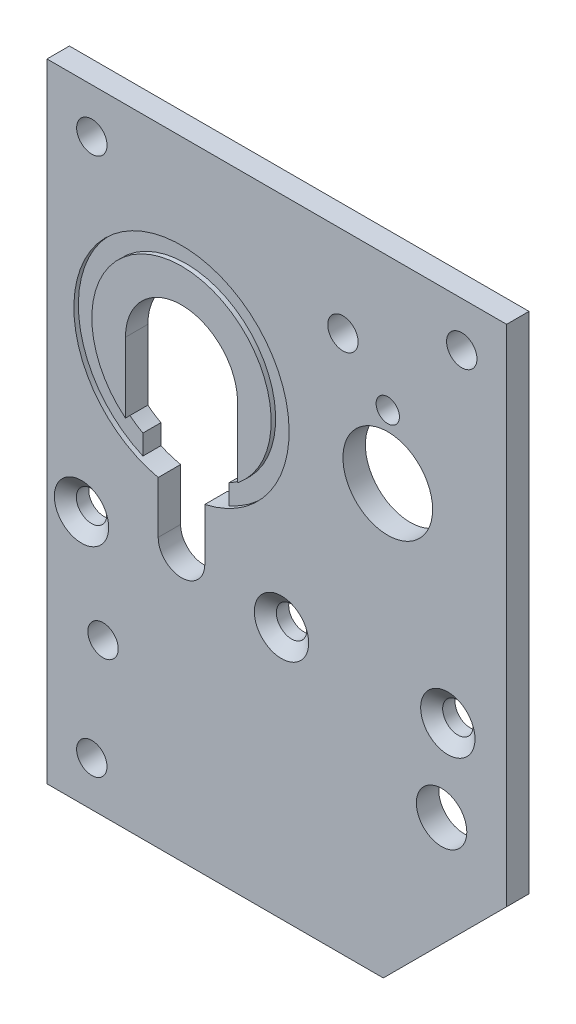
ISO-10303-21;
HEADER;
FILE_DESCRIPTION(('STEP AP214'),'2;1');
FILE_NAME('part.step','',(''),(''),'','','');
FILE_SCHEMA(('AUTOMOTIVE_DESIGN { 1 0 10303 214 1 1 1 1 }'));
ENDSEC;
DATA;
#1=APPLICATION_CONTEXT('core data for automotive mechanical design processes');
#2=APPLICATION_PROTOCOL_DEFINITION('international standard','automotive_design',2000,#1);
#3=PRODUCT_CONTEXT('',#1,'mechanical');
#4=PRODUCT('Part','Part','',(#3));
#5=PRODUCT_RELATED_PRODUCT_CATEGORY('part','',(#4));
#6=PRODUCT_DEFINITION_FORMATION('','',#4);
#7=PRODUCT_DEFINITION_CONTEXT('part definition',#1,'design');
#8=PRODUCT_DEFINITION('design','',#6,#7);
#9=PRODUCT_DEFINITION_SHAPE('','',#8);
#10=(LENGTH_UNIT() NAMED_UNIT(*) SI_UNIT(.MILLI.,.METRE.));
#11=(NAMED_UNIT(*) PLANE_ANGLE_UNIT() SI_UNIT($,.RADIAN.));
#12=(NAMED_UNIT(*) SI_UNIT($,.STERADIAN.) SOLID_ANGLE_UNIT());
#13=UNCERTAINTY_MEASURE_WITH_UNIT(LENGTH_MEASURE(1.E-05),#10,'distance_accuracy_value','');
#14=(GEOMETRIC_REPRESENTATION_CONTEXT(3) GLOBAL_UNCERTAINTY_ASSIGNED_CONTEXT((#13)) GLOBAL_UNIT_ASSIGNED_CONTEXT((#10,
#11,#12)) REPRESENTATION_CONTEXT('',''));
#15=CARTESIAN_POINT('',(0.,0.,0.));
#16=DIRECTION('',(0.,0.,1.));
#17=DIRECTION('',(1.,0.,0.));
#18=AXIS2_PLACEMENT_3D('',#15,#16,#17);
#19=CARTESIAN_POINT('',(0.,0.,0.));
#20=DIRECTION('',(0.,0.,1.));
#21=DIRECTION('',(1.,0.,0.));
#22=AXIS2_PLACEMENT_3D('',#19,#20,#21);
#23=PLANE('',#22);
#24=CARTESIAN_POINT('',(-31.8770000000221,-53.0918771734292,0.));
#25=DIRECTION('',(0.,0.,1.));
#26=DIRECTION('',(1.,0.,0.));
#27=AXIS2_PLACEMENT_3D('',#24,#25,#26);
#28=CIRCLE('',#27,3.8460045);
#29=CARTESIAN_POINT('',(-28.0309955000221,-53.0918771734292,0.));
#30=VERTEX_POINT('',#29);
#31=EDGE_CURVE('E516',#30,#30,#28,.T.);
#32=ORIENTED_EDGE('',*,*,#31,.F.);
#33=EDGE_LOOP('',(#32));
#34=FACE_BOUND('',#33,.T.);
#35=CARTESIAN_POINT('',(-60.1979999999866,-53.0918771734292,0.));
#36=DIRECTION('',(0.,0.,1.));
#37=DIRECTION('',(1.,0.,0.));
#38=AXIS2_PLACEMENT_3D('',#35,#36,#37);
#39=CIRCLE('',#38,3.8460045);
#40=CARTESIAN_POINT('',(-56.3519954999866,-53.0918771734292,0.));
#41=VERTEX_POINT('',#40);
#42=EDGE_CURVE('E505',#41,#41,#39,.T.);
#43=ORIENTED_EDGE('',*,*,#42,.F.);
#44=EDGE_LOOP('',(#43));
#45=FACE_BOUND('',#44,.T.);
#46=CARTESIAN_POINT('',(-8.32100012202219,-53.0918771734292,0.));
#47=DIRECTION('',(0.,0.,1.));
#48=DIRECTION('',(1.,0.,0.));
#49=AXIS2_PLACEMENT_3D('',#46,#47,#48);
#50=CIRCLE('',#49,3.8460045);
#51=CARTESIAN_POINT('',(-4.47499562202219,-53.0918771734292,0.));
#52=VERTEX_POINT('',#51);
#53=EDGE_CURVE('E495',#52,#52,#50,.T.);
#54=ORIENTED_EDGE('',*,*,#53,.F.);
#55=EDGE_LOOP('',(#54));
#56=FACE_BOUND('',#55,.T.);
#57=DIRECTION('',(0.,-1.,0.));
#58=VECTOR('',#57,1.);
#59=CARTESIAN_POINT('',(-49.3395000000005,-50.8,0.));
#60=LINE('',#59,#58);
#61=CARTESIAN_POINT('',(-49.3395000000004,-43.4529835999372,0.));
#62=VERTEX_POINT('',#61);
#63=CARTESIAN_POINT('',(-49.3395000000004,-50.8,0.));
#64=VERTEX_POINT('',#63);
#65=EDGE_CURVE('E272',#62,#64,#60,.T.);
#66=ORIENTED_EDGE('',*,*,#65,.F.);
#67=CARTESIAN_POINT('',(-46.0375000000004,-28.575,0.));
#68=DIRECTION('',(0.,0.,1.));
#69=DIRECTION('',(1.,0.,0.));
#70=AXIS2_PLACEMENT_3D('',#67,#68,#69);
#71=CIRCLE('',#70,15.24);
#72=CARTESIAN_POINT('',(-42.7355000000005,-43.4529835999372,0.));
#73=VERTEX_POINT('',#72);
#74=EDGE_CURVE('E248',#73,#62,#71,.T.);
#75=ORIENTED_EDGE('',*,*,#74,.F.);
#76=DIRECTION('',(0.,1.,0.));
#77=VECTOR('',#76,1.);
#78=CARTESIAN_POINT('',(-42.7355000000005,-43.4529835999372,0.));
#79=LINE('',#78,#77);
#80=CARTESIAN_POINT('',(-42.7355000000005,-50.8,0.));
#81=VERTEX_POINT('',#80);
#82=EDGE_CURVE('E280',#81,#73,#79,.T.);
#83=ORIENTED_EDGE('',*,*,#82,.F.);
#84=CARTESIAN_POINT('',(-46.0375000000004,-50.8,0.));
#85=DIRECTION('',(0.,0.,1.));
#86=DIRECTION('',(1.,0.,0.));
#87=AXIS2_PLACEMENT_3D('',#84,#85,#86);
#88=CIRCLE('',#87,3.30199999999998);
#89=EDGE_CURVE('E276',#64,#81,#88,.T.);
#90=ORIENTED_EDGE('',*,*,#89,.F.);
#91=EDGE_LOOP('',(#66,#75,#83,#90));
#92=FACE_BOUND('',#91,.T.);
#93=CARTESIAN_POINT('',(-9.20750000000048,-65.0874999999984,0.));
#94=DIRECTION('',(0.,0.,1.));
#95=DIRECTION('',(1.,0.,0.));
#96=AXIS2_PLACEMENT_3D('',#93,#94,#95);
#97=CIRCLE('',#96,3.57124);
#98=CARTESIAN_POINT('',(-5.63626000000048,-65.0874999999984,0.));
#99=VERTEX_POINT('',#98);
#100=EDGE_CURVE('E226',#99,#99,#97,.T.);
#101=ORIENTED_EDGE('',*,*,#100,.F.);
#102=EDGE_LOOP('',(#101));
#103=FACE_BOUND('',#102,.T.);
#104=CARTESIAN_POINT('',(-16.8275000000007,-18.9483999999992,0.));
#105=DIRECTION('',(0.,0.,1.));
#106=DIRECTION('',(1.,0.,0.));
#107=AXIS2_PLACEMENT_3D('',#104,#105,#106);
#108=CIRCLE('',#107,1.65099999999931);
#109=CARTESIAN_POINT('',(-15.1765000000014,-18.9483999999992,0.));
#110=VERTEX_POINT('',#109);
#111=EDGE_CURVE('E235',#110,#110,#108,.T.);
#112=ORIENTED_EDGE('',*,*,#111,.F.);
#113=EDGE_LOOP('',(#112));
#114=FACE_BOUND('',#113,.T.);
#115=CARTESIAN_POINT('',(-16.8275000000007,-27.9399999999992,0.));
#116=DIRECTION('',(0.,0.,1.));
#117=DIRECTION('',(1.,0.,0.));
#118=AXIS2_PLACEMENT_3D('',#115,#116,#117);
#119=CIRCLE('',#118,6.34999999999932);
#120=CARTESIAN_POINT('',(-10.4775000000013,-27.9399999999992,0.));
#121=VERTEX_POINT('',#120);
#122=EDGE_CURVE('E240',#121,#121,#119,.T.);
#123=ORIENTED_EDGE('',*,*,#122,.F.);
#124=EDGE_LOOP('',(#123));
#125=FACE_BOUND('',#124,.T.);
#126=CARTESIAN_POINT('',(-58.7374999999835,-6.35000000005267,0.));
#127=DIRECTION('',(0.,0.,1.));
#128=DIRECTION('',(1.,0.,0.));
#129=AXIS2_PLACEMENT_3D('',#126,#127,#128);
#130=CIRCLE('',#129,2.15264999999999);
#131=CARTESIAN_POINT('',(-56.5848499999835,-6.35000000005267,0.));
#132=VERTEX_POINT('',#131);
#133=EDGE_CURVE('E287',#132,#132,#130,.T.);
#134=ORIENTED_EDGE('',*,*,#133,.F.);
#135=EDGE_LOOP('',(#134));
#136=FACE_BOUND('',#135,.T.);
#137=CARTESIAN_POINT('',(-6.34999999998342,-6.35000000005133,0.));
#138=DIRECTION('',(0.,0.,1.));
#139=DIRECTION('',(1.,0.,0.));
#140=AXIS2_PLACEMENT_3D('',#137,#138,#139);
#141=CIRCLE('',#140,2.15264999999999);
#142=CARTESIAN_POINT('',(-4.19734999998343,-6.35000000005133,0.));
#143=VERTEX_POINT('',#142);
#144=EDGE_CURVE('E302',#143,#143,#141,.T.);
#145=ORIENTED_EDGE('',*,*,#144,.F.);
#146=EDGE_LOOP('',(#145));
#147=FACE_BOUND('',#146,.T.);
#148=CARTESIAN_POINT('',(-23.1775000000004,-12.7,0.));
#149=DIRECTION('',(0.,0.,1.));
#150=DIRECTION('',(1.,0.,0.));
#151=AXIS2_PLACEMENT_3D('',#148,#149,#150);
#152=CIRCLE('',#151,2.15264999999999);
#153=CARTESIAN_POINT('',(-21.0248500000005,-12.7,0.));
#154=VERTEX_POINT('',#153);
#155=EDGE_CURVE('E308',#154,#154,#152,.T.);
#156=ORIENTED_EDGE('',*,*,#155,.F.);
#157=EDGE_LOOP('',(#156));
#158=FACE_BOUND('',#157,.T.);
#159=CARTESIAN_POINT('',(-57.1499999999841,-67.3100000000529,0.));
#160=DIRECTION('',(0.,0.,1.));
#161=DIRECTION('',(1.,0.,0.));
#162=AXIS2_PLACEMENT_3D('',#159,#160,#161);
#163=CIRCLE('',#162,2.15264999999999);
#164=CARTESIAN_POINT('',(-54.9973499999841,-67.3100000000529,0.));
#165=VERTEX_POINT('',#164);
#166=EDGE_CURVE('E314',#165,#165,#163,.T.);
#167=ORIENTED_EDGE('',*,*,#166,.F.);
#168=EDGE_LOOP('',(#167));
#169=FACE_BOUND('',#168,.T.);
#170=CARTESIAN_POINT('',(-58.7375000000005,-82.55,0.));
#171=DIRECTION('',(0.,0.,1.));
#172=DIRECTION('',(1.,0.,0.));
#173=AXIS2_PLACEMENT_3D('',#170,#171,#172);
#174=CIRCLE('',#173,2.15264999999999);
#175=CARTESIAN_POINT('',(-56.5848500000005,-82.55,0.));
#176=VERTEX_POINT('',#175);
#177=EDGE_CURVE('E320',#176,#176,#174,.T.);
#178=ORIENTED_EDGE('',*,*,#177,.F.);
#179=EDGE_LOOP('',(#178));
#180=FACE_BOUND('',#179,.T.);
#181=DIRECTION('',(-1.,0.,0.));
#182=VECTOR('',#181,1.);
#183=CARTESIAN_POINT('',(-4.44001085897483E-13,0.,0.));
#184=LINE('',#183,#182);
#185=CARTESIAN_POINT('',(-4.44001085897483E-13,0.,0.));
#186=VERTEX_POINT('',#185);
#187=CARTESIAN_POINT('',(-65.0875000000004,0.,0.));
#188=VERTEX_POINT('',#187);
#189=EDGE_CURVE('E326',#186,#188,#184,.T.);
#190=ORIENTED_EDGE('',*,*,#189,.T.);
#191=DIRECTION('',(0.,-1.,0.));
#192=VECTOR('',#191,1.);
#193=CARTESIAN_POINT('',(-65.0875000000004,0.,0.));
#194=LINE('',#193,#192);
#195=CARTESIAN_POINT('',(-65.0875000000004,-88.9,0.));
#196=VERTEX_POINT('',#195);
#197=EDGE_CURVE('E348',#188,#196,#194,.T.);
#198=ORIENTED_EDGE('',*,*,#197,.T.);
#199=DIRECTION('',(1.,0.,0.));
#200=VECTOR('',#199,1.);
#201=CARTESIAN_POINT('',(-65.0875000000004,-88.9,0.));
#202=LINE('',#201,#200);
#203=CARTESIAN_POINT('',(-17.4625000000004,-88.9,0.));
#204=VERTEX_POINT('',#203);
#205=EDGE_CURVE('E352',#196,#204,#202,.T.);
#206=ORIENTED_EDGE('',*,*,#205,.T.);
#207=DIRECTION('',(0.707106781186549,0.707106781186547,0.));
#208=VECTOR('',#207,1.);
#209=CARTESIAN_POINT('',(-17.4625000000004,-88.9,0.));
#210=LINE('',#209,#208);
#211=CARTESIAN_POINT('',(-4.20334253514731E-13,-71.4375,0.));
#212=VERTEX_POINT('',#211);
#213=EDGE_CURVE('E355',#204,#212,#210,.T.);
#214=ORIENTED_EDGE('',*,*,#213,.T.);
#215=DIRECTION('',(0.,1.,0.));
#216=VECTOR('',#215,1.);
#217=CARTESIAN_POINT('',(-4.20334253514731E-13,-71.4375,0.));
#218=LINE('',#217,#216);
#219=EDGE_CURVE('E331',#212,#186,#218,.T.);
#220=ORIENTED_EDGE('',*,*,#219,.T.);
#221=EDGE_LOOP('',(#190,#198,#206,#214,#220));
#222=FACE_BOUND('',#221,.T.);
#223=ADVANCED_FACE('F38',(#34,#45,#56,#92,#103,#114,#125,#136,#147,#158,#169,#180,#222),#23,.T.);
#224=CARTESIAN_POINT('',(-46.0375000000004,-28.575,0.));
#225=DIRECTION('',(0.,0.,-1.));
#226=DIRECTION('',(-1.,0.,0.));
#227=AXIS2_PLACEMENT_3D('',#224,#225,#226);
#228=CYLINDRICAL_SURFACE('',#227,12.7000000000343);
#229=DIRECTION('',(0.,0.,-1.));
#230=VECTOR('',#229,1.);
#231=CARTESIAN_POINT('',(-53.9749999999831,-38.4889343225103,0.));
#232=LINE('',#231,#230);
#233=CARTESIAN_POINT('',(-53.9749999999831,-38.4889343225152,-0.635));
#234=VERTEX_POINT('',#233);
#235=CARTESIAN_POINT('',(-53.9749999999831,-38.4889343225103,-3.175));
#236=VERTEX_POINT('',#235);
#237=EDGE_CURVE('E467',#234,#236,#232,.T.);
#238=ORIENTED_EDGE('',*,*,#237,.F.);
#239=CARTESIAN_POINT('',(-46.0375000000004,-28.575,-0.635));
#240=DIRECTION('',(0.,0.,-1.));
#241=DIRECTION('',(1.,0.,0.));
#242=AXIS2_PLACEMENT_3D('',#239,#240,#241);
#243=CIRCLE('',#242,12.7000000000343);
#244=CARTESIAN_POINT('',(-52.1334999999831,-39.7163097973792,-0.635));
#245=VERTEX_POINT('',#244);
#246=EDGE_CURVE('E196',#245,#234,#243,.T.);
#247=ORIENTED_EDGE('',*,*,#246,.F.);
#248=DIRECTION('',(0.,0.,-1.));
#249=VECTOR('',#248,1.);
#250=CARTESIAN_POINT('',(-52.1334999999831,-39.7163097973792,0.));
#251=LINE('',#250,#249);
#252=CARTESIAN_POINT('',(-52.1334999999831,-39.7163097973792,-3.175));
#253=VERTEX_POINT('',#252);
#254=EDGE_CURVE('E222',#245,#253,#251,.T.);
#255=ORIENTED_EDGE('',*,*,#254,.T.);
#256=CARTESIAN_POINT('',(-46.0375000000004,-28.575,-3.175));
#257=DIRECTION('',(0.,0.,1.));
#258=DIRECTION('',(-1.,0.,0.));
#259=AXIS2_PLACEMENT_3D('',#256,#257,#258);
#260=CIRCLE('',#259,12.7000000000343);
#261=EDGE_CURVE('E444',#236,#253,#260,.T.);
#262=ORIENTED_EDGE('',*,*,#261,.F.);
#263=EDGE_LOOP('',(#238,#247,#255,#262));
#264=FACE_BOUND('',#263,.T.);
#265=ADVANCED_FACE('F396',(#264),#228,.F.);
#266=CARTESIAN_POINT('',(-46.0375000000004,-28.575,0.));
#267=DIRECTION('',(0.,0.,-1.));
#268=DIRECTION('',(-1.,0.,0.));
#269=AXIS2_PLACEMENT_3D('',#266,#267,#268);
#270=CYLINDRICAL_SURFACE('',#269,12.7000000000534);
#271=DIRECTION('',(0.,0.,-1.));
#272=VECTOR('',#271,1.);
#273=CARTESIAN_POINT('',(-39.9414999999832,-39.7163097973792,0.));
#274=LINE('',#273,#272);
#275=CARTESIAN_POINT('',(-39.9414999999832,-39.7163097973792,-0.635));
#276=VERTEX_POINT('',#275);
#277=CARTESIAN_POINT('',(-39.9414999999832,-39.7163097973792,-3.175));
#278=VERTEX_POINT('',#277);
#279=EDGE_CURVE('E200',#276,#278,#274,.T.);
#280=ORIENTED_EDGE('',*,*,#279,.F.);
#281=CARTESIAN_POINT('',(-38.0999999999943,-38.4889343224964,-0.635));
#282=VERTEX_POINT('',#281);
#283=EDGE_CURVE('E183',#282,#276,#243,.T.);
#284=ORIENTED_EDGE('',*,*,#283,.F.);
#285=DIRECTION('',(0.,0.,-1.));
#286=VECTOR('',#285,1.);
#287=CARTESIAN_POINT('',(-38.0999999999823,-38.4889343225113,0.));
#288=LINE('',#287,#286);
#289=CARTESIAN_POINT('',(-38.0999999999823,-38.4889343225113,-3.175));
#290=VERTEX_POINT('',#289);
#291=EDGE_CURVE('E210',#282,#290,#288,.T.);
#292=ORIENTED_EDGE('',*,*,#291,.T.);
#293=CARTESIAN_POINT('',(-46.0375000000004,-28.575,-3.175));
#294=DIRECTION('',(0.,0.,1.));
#295=DIRECTION('',(-1.,0.,0.));
#296=AXIS2_PLACEMENT_3D('',#293,#294,#295);
#297=CIRCLE('',#296,12.7000000000534);
#298=EDGE_CURVE('E207',#278,#290,#297,.T.);
#299=ORIENTED_EDGE('',*,*,#298,.F.);
#300=EDGE_LOOP('',(#280,#284,#292,#299));
#301=FACE_BOUND('',#300,.T.);
#302=ADVANCED_FACE('F205',(#301),#270,.F.);
#303=CARTESIAN_POINT('',(-39.9414999999831,-42.5426907182782,0.));
#304=DIRECTION('',(-1.,0.,0.));
#305=DIRECTION('',(0.,-1.,0.));
#306=AXIS2_PLACEMENT_3D('',#303,#304,#305);
#307=PLANE('',#306);
#308=DIRECTION('',(0.,0.,-1.));
#309=VECTOR('',#308,1.);
#310=CARTESIAN_POINT('',(-39.9414999999859,-42.5426907182719,0.));
#311=LINE('',#310,#309);
#312=CARTESIAN_POINT('',(-39.9414999999873,-42.5426907182687,-0.635));
#313=VERTEX_POINT('',#312);
#314=CARTESIAN_POINT('',(-39.9414999999859,-42.5426907182719,-3.175));
#315=VERTEX_POINT('',#314);
#316=EDGE_CURVE('E202',#313,#315,#311,.T.);
#317=ORIENTED_EDGE('',*,*,#316,.F.);
#318=DIRECTION('',(-9.7219803800522E-13,-1.,0.));
#319=VECTOR('',#318,1.);
#320=CARTESIAN_POINT('',(-39.9414999999859,-42.5426907182719,-0.635));
#321=LINE('',#320,#319);
#322=EDGE_CURVE('E187',#276,#313,#321,.T.);
#323=ORIENTED_EDGE('',*,*,#322,.F.);
#324=ORIENTED_EDGE('',*,*,#279,.T.);
#325=DIRECTION('',(0.,1.,0.));
#326=VECTOR('',#325,1.);
#327=CARTESIAN_POINT('',(-39.9414999999831,-42.5426907182782,-3.175));
#328=LINE('',#327,#326);
#329=EDGE_CURVE('E450',#315,#278,#328,.T.);
#330=ORIENTED_EDGE('',*,*,#329,.F.);
#331=EDGE_LOOP('',(#317,#323,#324,#330));
#332=FACE_BOUND('',#331,.T.);
#333=ADVANCED_FACE('F198',(#332),#307,.T.);
#334=CARTESIAN_POINT('',(-52.1334999999831,-39.7163097973792,0.));
#335=DIRECTION('',(1.,0.,0.));
#336=DIRECTION('',(0.,1.,0.));
#337=AXIS2_PLACEMENT_3D('',#334,#335,#336);
#338=PLANE('',#337);
#339=ORIENTED_EDGE('',*,*,#254,.F.);
#340=DIRECTION('',(0.,1.,0.));
#341=VECTOR('',#340,1.);
#342=CARTESIAN_POINT('',(-52.1334999999831,-39.7163097973792,-0.635));
#343=LINE('',#342,#341);
#344=CARTESIAN_POINT('',(-52.1334999999832,-42.5426907182782,-0.635));
#345=VERTEX_POINT('',#344);
#346=EDGE_CURVE('E448',#345,#245,#343,.T.);
#347=ORIENTED_EDGE('',*,*,#346,.F.);
#348=DIRECTION('',(0.,0.,-1.));
#349=VECTOR('',#348,1.);
#350=CARTESIAN_POINT('',(-52.1334999999832,-42.5426907182782,0.));
#351=LINE('',#350,#349);
#352=CARTESIAN_POINT('',(-52.1334999999832,-42.542690718233,-3.175));
#353=VERTEX_POINT('',#352);
#354=EDGE_CURVE('E65',#345,#353,#351,.T.);
#355=ORIENTED_EDGE('',*,*,#354,.T.);
#356=DIRECTION('',(0.,-1.,0.));
#357=VECTOR('',#356,1.);
#358=CARTESIAN_POINT('',(-52.1334999999831,-39.7163097973792,-3.175));
#359=LINE('',#358,#357);
#360=EDGE_CURVE('E447',#253,#353,#359,.T.);
#361=ORIENTED_EDGE('',*,*,#360,.F.);
#362=EDGE_LOOP('',(#339,#347,#355,#361));
#363=FACE_BOUND('',#362,.T.);
#364=ADVANCED_FACE('F565',(#363),#338,.T.);
#365=CARTESIAN_POINT('',(-4.44001085897483E-13,0.,-3.175));
#366=DIRECTION('',(0.,1.,0.));
#367=DIRECTION('',(-1.,0.,0.));
#368=AXIS2_PLACEMENT_3D('',#365,#366,#367);
#369=PLANE('',#368);
#370=ORIENTED_EDGE('',*,*,#189,.F.);
#371=DIRECTION('',(0.,0.,1.));
#372=VECTOR('',#371,1.);
#373=CARTESIAN_POINT('',(-4.44001085897483E-13,0.,-3.175));
#374=LINE('',#373,#372);
#375=CARTESIAN_POINT('',(-4.44001085897483E-13,0.,-3.175));
#376=VERTEX_POINT('',#375);
#377=EDGE_CURVE('E11',#376,#186,#374,.T.);
#378=ORIENTED_EDGE('',*,*,#377,.F.);
#379=DIRECTION('',(-1.,0.,0.));
#380=VECTOR('',#379,1.);
#381=CARTESIAN_POINT('',(-4.44001085897483E-13,0.,-3.175));
#382=LINE('',#381,#380);
#383=CARTESIAN_POINT('',(-65.0875000000004,0.,-3.175));
#384=VERTEX_POINT('',#383);
#385=EDGE_CURVE('E327',#376,#384,#382,.T.);
#386=ORIENTED_EDGE('',*,*,#385,.T.);
#387=DIRECTION('',(0.,0.,1.));
#388=VECTOR('',#387,1.);
#389=CARTESIAN_POINT('',(-65.0875000000004,0.,-3.175));
#390=LINE('',#389,#388);
#391=EDGE_CURVE('E42',#384,#188,#390,.T.);
#392=ORIENTED_EDGE('',*,*,#391,.T.);
#393=EDGE_LOOP('',(#370,#378,#386,#392));
#394=FACE_BOUND('',#393,.T.);
#395=ADVANCED_FACE('F40',(#394),#369,.T.);
#396=CARTESIAN_POINT('',(-4.20334253514731E-13,-71.4375,-3.175));
#397=DIRECTION('',(1.,0.,0.));
#398=DIRECTION('',(0.,1.,0.));
#399=AXIS2_PLACEMENT_3D('',#396,#397,#398);
#400=PLANE('',#399);
#401=ORIENTED_EDGE('',*,*,#219,.F.);
#402=DIRECTION('',(0.,0.,1.));
#403=VECTOR('',#402,1.);
#404=CARTESIAN_POINT('',(-4.20334253514731E-13,-71.4375,-3.175));
#405=LINE('',#404,#403);
#406=CARTESIAN_POINT('',(-4.20334253514731E-13,-71.4375,-3.175));
#407=VERTEX_POINT('',#406);
#408=EDGE_CURVE('E47',#407,#212,#405,.T.);
#409=ORIENTED_EDGE('',*,*,#408,.F.);
#410=DIRECTION('',(0.,1.,0.));
#411=VECTOR('',#410,1.);
#412=CARTESIAN_POINT('',(-4.20334253514731E-13,-71.4375,-3.175));
#413=LINE('',#412,#411);
#414=EDGE_CURVE('E342',#407,#376,#413,.T.);
#415=ORIENTED_EDGE('',*,*,#414,.T.);
#416=ORIENTED_EDGE('',*,*,#377,.T.);
#417=EDGE_LOOP('',(#401,#409,#415,#416));
#418=FACE_BOUND('',#417,.T.);
#419=ADVANCED_FACE('F377',(#418),#400,.T.);
#420=CARTESIAN_POINT('',(-17.4625000000004,-88.9,-3.175));
#421=DIRECTION('',(0.707106781186547,-0.707106781186548,0.));
#422=DIRECTION('',(0.707106781186548,0.707106781186547,0.));
#423=AXIS2_PLACEMENT_3D('',#420,#421,#422);
#424=PLANE('',#423);
#425=ORIENTED_EDGE('',*,*,#213,.F.);
#426=DIRECTION('',(0.,0.,1.));
#427=VECTOR('',#426,1.);
#428=CARTESIAN_POINT('',(-17.4625000000004,-88.9,-3.175));
#429=LINE('',#428,#427);
#430=CARTESIAN_POINT('',(-17.4625000000004,-88.9,-3.175));
#431=VERTEX_POINT('',#430);
#432=EDGE_CURVE('E363',#431,#204,#429,.T.);
#433=ORIENTED_EDGE('',*,*,#432,.F.);
#434=DIRECTION('',(0.707106781186549,0.707106781186547,0.));
#435=VECTOR('',#434,1.);
#436=CARTESIAN_POINT('',(-17.4625000000004,-88.9,-3.175));
#437=LINE('',#436,#435);
#438=EDGE_CURVE('E338',#431,#407,#437,.T.);
#439=ORIENTED_EDGE('',*,*,#438,.T.);
#440=ORIENTED_EDGE('',*,*,#408,.T.);
#441=EDGE_LOOP('',(#425,#433,#439,#440));
#442=FACE_BOUND('',#441,.T.);
#443=ADVANCED_FACE('F386',(#442),#424,.T.);
#444=CARTESIAN_POINT('',(-65.0875000000004,-88.9,-3.175));
#445=DIRECTION('',(0.,-1.,0.));
#446=DIRECTION('',(0.,0.,-1.));
#447=AXIS2_PLACEMENT_3D('',#444,#445,#446);
#448=PLANE('',#447);
#449=ORIENTED_EDGE('',*,*,#205,.F.);
#450=DIRECTION('',(0.,0.,1.));
#451=VECTOR('',#450,1.);
#452=CARTESIAN_POINT('',(-65.0875000000004,-88.9,-3.175));
#453=LINE('',#452,#451);
#454=CARTESIAN_POINT('',(-65.0875000000004,-88.9,-3.175));
#455=VERTEX_POINT('',#454);
#456=EDGE_CURVE('E364',#455,#196,#453,.T.);
#457=ORIENTED_EDGE('',*,*,#456,.F.);
#458=DIRECTION('',(1.,0.,0.));
#459=VECTOR('',#458,1.);
#460=CARTESIAN_POINT('',(-65.0875000000004,-88.9,-3.175));
#461=LINE('',#460,#459);
#462=EDGE_CURVE('E335',#455,#431,#461,.T.);
#463=ORIENTED_EDGE('',*,*,#462,.T.);
#464=ORIENTED_EDGE('',*,*,#432,.T.);
#465=EDGE_LOOP('',(#449,#457,#463,#464));
#466=FACE_BOUND('',#465,.T.);
#467=ADVANCED_FACE('F384',(#466),#448,.T.);
#468=CARTESIAN_POINT('',(-65.0875000000004,0.,-3.175));
#469=DIRECTION('',(-1.,0.,0.));
#470=DIRECTION('',(0.,0.,1.));
#471=AXIS2_PLACEMENT_3D('',#468,#469,#470);
#472=PLANE('',#471);
#473=ORIENTED_EDGE('',*,*,#197,.F.);
#474=ORIENTED_EDGE('',*,*,#391,.F.);
#475=DIRECTION('',(0.,-1.,0.));
#476=VECTOR('',#475,1.);
#477=CARTESIAN_POINT('',(-65.0875000000004,0.,-3.175));
#478=LINE('',#477,#476);
#479=EDGE_CURVE('E330',#384,#455,#478,.T.);
#480=ORIENTED_EDGE('',*,*,#479,.T.);
#481=ORIENTED_EDGE('',*,*,#456,.T.);
#482=EDGE_LOOP('',(#473,#474,#480,#481));
#483=FACE_BOUND('',#482,.T.);
#484=ADVANCED_FACE('F372',(#483),#472,.T.);
#485=CARTESIAN_POINT('',(0.,0.,-3.175));
#486=DIRECTION('',(0.,0.,1.));
#487=DIRECTION('',(1.,0.,0.));
#488=AXIS2_PLACEMENT_3D('',#485,#486,#487);
#489=PLANE('',#488);
#490=CARTESIAN_POINT('',(-31.8770000000221,-53.0918771734292,-3.175));
#491=DIRECTION('',(0.,0.,1.));
#492=DIRECTION('',(1.,0.,0.));
#493=AXIS2_PLACEMENT_3D('',#490,#491,#492);
#494=CIRCLE('',#493,2.15265);
#495=CARTESIAN_POINT('',(-29.7243500000221,-53.0918771734292,-3.175));
#496=VERTEX_POINT('',#495);
#497=EDGE_CURVE('E508',#496,#496,#494,.T.);
#498=ORIENTED_EDGE('',*,*,#497,.T.);
#499=EDGE_LOOP('',(#498));
#500=FACE_BOUND('',#499,.T.);
#501=CARTESIAN_POINT('',(-60.1979999999866,-53.0918771734292,-3.175));
#502=DIRECTION('',(0.,0.,1.));
#503=DIRECTION('',(1.,0.,0.));
#504=AXIS2_PLACEMENT_3D('',#501,#502,#503);
#505=CIRCLE('',#504,2.15265);
#506=CARTESIAN_POINT('',(-58.0453499999867,-53.0918771734292,-3.175));
#507=VERTEX_POINT('',#506);
#508=EDGE_CURVE('E499',#507,#507,#505,.T.);
#509=ORIENTED_EDGE('',*,*,#508,.T.);
#510=EDGE_LOOP('',(#509));
#511=FACE_BOUND('',#510,.T.);
#512=CARTESIAN_POINT('',(-8.32100012202219,-53.0918771734292,-3.175));
#513=DIRECTION('',(0.,0.,1.));
#514=DIRECTION('',(1.,0.,0.));
#515=AXIS2_PLACEMENT_3D('',#512,#513,#514);
#516=CIRCLE('',#515,2.15265);
#517=CARTESIAN_POINT('',(-6.16835012202219,-53.0918771734292,-3.175));
#518=VERTEX_POINT('',#517);
#519=EDGE_CURVE('E429',#518,#518,#516,.T.);
#520=ORIENTED_EDGE('',*,*,#519,.T.);
#521=EDGE_LOOP('',(#520));
#522=FACE_BOUND('',#521,.T.);
#523=CARTESIAN_POINT('',(-9.20750000000048,-65.0874999999984,-3.175));
#524=DIRECTION('',(0.,0.,1.));
#525=DIRECTION('',(1.,0.,0.));
#526=AXIS2_PLACEMENT_3D('',#523,#524,#525);
#527=CIRCLE('',#526,3.57124);
#528=CARTESIAN_POINT('',(-5.63626000000048,-65.0874999999984,-3.175));
#529=VERTEX_POINT('',#528);
#530=EDGE_CURVE('E230',#529,#529,#527,.T.);
#531=ORIENTED_EDGE('',*,*,#530,.T.);
#532=EDGE_LOOP('',(#531));
#533=FACE_BOUND('',#532,.T.);
#534=CARTESIAN_POINT('',(-16.8275000000007,-18.9483999999992,-3.175));
#535=DIRECTION('',(0.,0.,1.));
#536=DIRECTION('',(1.,0.,0.));
#537=AXIS2_PLACEMENT_3D('',#534,#535,#536);
#538=CIRCLE('',#537,1.65099999999931);
#539=CARTESIAN_POINT('',(-15.1765000000014,-18.9483999999992,-3.175));
#540=VERTEX_POINT('',#539);
#541=EDGE_CURVE('E236',#540,#540,#538,.T.);
#542=ORIENTED_EDGE('',*,*,#541,.T.);
#543=EDGE_LOOP('',(#542));
#544=FACE_BOUND('',#543,.T.);
#545=CARTESIAN_POINT('',(-16.8275000000007,-27.9399999999992,-3.175));
#546=DIRECTION('',(0.,0.,1.));
#547=DIRECTION('',(1.,0.,0.));
#548=AXIS2_PLACEMENT_3D('',#545,#546,#547);
#549=CIRCLE('',#548,6.34999999999932);
#550=CARTESIAN_POINT('',(-10.4775000000013,-27.9399999999992,-3.175));
#551=VERTEX_POINT('',#550);
#552=EDGE_CURVE('E244',#551,#551,#549,.T.);
#553=ORIENTED_EDGE('',*,*,#552,.T.);
#554=EDGE_LOOP('',(#553));
#555=FACE_BOUND('',#554,.T.);
#556=DIRECTION('',(0.,1.,0.));
#557=VECTOR('',#556,1.);
#558=CARTESIAN_POINT('',(-42.7355000000005,-43.4529835999372,-3.175));
#559=LINE('',#558,#557);
#560=CARTESIAN_POINT('',(-42.7355000000005,-50.8,-3.175));
#561=VERTEX_POINT('',#560);
#562=CARTESIAN_POINT('',(-42.7355000000005,-43.4529835999372,-3.175));
#563=VERTEX_POINT('',#562);
#564=EDGE_CURVE('E265',#561,#563,#559,.T.);
#565=ORIENTED_EDGE('',*,*,#564,.T.);
#566=CARTESIAN_POINT('',(-46.0375000000004,-28.575,-3.175));
#567=DIRECTION('',(0.,0.,1.));
#568=DIRECTION('',(1.,0.,0.));
#569=AXIS2_PLACEMENT_3D('',#566,#567,#568);
#570=CIRCLE('',#569,15.24);
#571=EDGE_CURVE('E252',#563,#315,#570,.T.);
#572=ORIENTED_EDGE('',*,*,#571,.T.);
#573=ORIENTED_EDGE('',*,*,#329,.T.);
#574=ORIENTED_EDGE('',*,*,#298,.T.);
#575=DIRECTION('',(0.,1.,0.));
#576=VECTOR('',#575,1.);
#577=CARTESIAN_POINT('',(-38.0999999999831,-38.4889343225103,-3.175));
#578=LINE('',#577,#576);
#579=CARTESIAN_POINT('',(-38.0999999999831,-28.5750000000528,-3.175));
#580=VERTEX_POINT('',#579);
#581=EDGE_CURVE('E455',#290,#580,#578,.T.);
#582=ORIENTED_EDGE('',*,*,#581,.T.);
#583=CARTESIAN_POINT('',(-46.0375000000004,-28.575,-3.175));
#584=DIRECTION('',(0.,0.,1.));
#585=DIRECTION('',(-1.,0.,0.));
#586=AXIS2_PLACEMENT_3D('',#583,#584,#585);
#587=CIRCLE('',#586,7.9375);
#588=CARTESIAN_POINT('',(-53.9750000000005,-28.5750000000528,-3.175));
#589=VERTEX_POINT('',#588);
#590=EDGE_CURVE('E459',#580,#589,#587,.T.);
#591=ORIENTED_EDGE('',*,*,#590,.T.);
#592=DIRECTION('',(0.,-1.,0.));
#593=VECTOR('',#592,1.);
#594=CARTESIAN_POINT('',(-53.9749999999831,-28.5750000000528,-3.175));
#595=LINE('',#594,#593);
#596=EDGE_CURVE('E462',#589,#236,#595,.T.);
#597=ORIENTED_EDGE('',*,*,#596,.T.);
#598=ORIENTED_EDGE('',*,*,#261,.T.);
#599=ORIENTED_EDGE('',*,*,#360,.T.);
#600=CARTESIAN_POINT('',(-49.3395000000004,-43.4529835999372,-3.175));
#601=VERTEX_POINT('',#600);
#602=EDGE_CURVE('E257',#353,#601,#570,.T.);
#603=ORIENTED_EDGE('',*,*,#602,.T.);
#604=DIRECTION('',(0.,-1.,0.));
#605=VECTOR('',#604,1.);
#606=CARTESIAN_POINT('',(-49.3395000000005,-50.8,-3.175));
#607=LINE('',#606,#605);
#608=CARTESIAN_POINT('',(-49.3395000000005,-50.8,-3.175));
#609=VERTEX_POINT('',#608);
#610=EDGE_CURVE('E256',#601,#609,#607,.T.);
#611=ORIENTED_EDGE('',*,*,#610,.T.);
#612=CARTESIAN_POINT('',(-46.0375000000004,-50.8,-3.175));
#613=DIRECTION('',(0.,0.,1.));
#614=DIRECTION('',(1.,0.,0.));
#615=AXIS2_PLACEMENT_3D('',#612,#613,#614);
#616=CIRCLE('',#615,3.30199999999998);
#617=EDGE_CURVE('E261',#609,#561,#616,.T.);
#618=ORIENTED_EDGE('',*,*,#617,.T.);
#619=EDGE_LOOP('',(#565,#572,#573,#574,#582,#591,#597,#598,#599,#603,#611,#618));
#620=FACE_BOUND('',#619,.T.);
#621=CARTESIAN_POINT('',(-58.7374999999835,-6.35000000005267,-3.175));
#622=DIRECTION('',(0.,0.,1.));
#623=DIRECTION('',(1.,0.,0.));
#624=AXIS2_PLACEMENT_3D('',#621,#622,#623);
#625=CIRCLE('',#624,2.15265);
#626=CARTESIAN_POINT('',(-56.5848499999835,-6.35000000005267,-3.175));
#627=VERTEX_POINT('',#626);
#628=EDGE_CURVE('E299',#627,#627,#625,.T.);
#629=ORIENTED_EDGE('',*,*,#628,.T.);
#630=EDGE_LOOP('',(#629));
#631=FACE_BOUND('',#630,.T.);
#632=CARTESIAN_POINT('',(-6.34999999998342,-6.35000000005133,-3.175));
#633=DIRECTION('',(0.,0.,1.));
#634=DIRECTION('',(1.,0.,0.));
#635=AXIS2_PLACEMENT_3D('',#632,#633,#634);
#636=CIRCLE('',#635,2.15265);
#637=CARTESIAN_POINT('',(-4.19734999998342,-6.35000000005133,-3.175));
#638=VERTEX_POINT('',#637);
#639=EDGE_CURVE('E305',#638,#638,#636,.T.);
#640=ORIENTED_EDGE('',*,*,#639,.T.);
#641=EDGE_LOOP('',(#640));
#642=FACE_BOUND('',#641,.T.);
#643=CARTESIAN_POINT('',(-23.1775000000004,-12.7,-3.175));
#644=DIRECTION('',(0.,0.,1.));
#645=DIRECTION('',(1.,0.,0.));
#646=AXIS2_PLACEMENT_3D('',#643,#644,#645);
#647=CIRCLE('',#646,2.15265);
#648=CARTESIAN_POINT('',(-21.0248500000004,-12.7,-3.175));
#649=VERTEX_POINT('',#648);
#650=EDGE_CURVE('E311',#649,#649,#647,.T.);
#651=ORIENTED_EDGE('',*,*,#650,.T.);
#652=EDGE_LOOP('',(#651));
#653=FACE_BOUND('',#652,.T.);
#654=CARTESIAN_POINT('',(-57.1499999999841,-67.3100000000529,-3.175));
#655=DIRECTION('',(0.,0.,1.));
#656=DIRECTION('',(1.,0.,0.));
#657=AXIS2_PLACEMENT_3D('',#654,#655,#656);
#658=CIRCLE('',#657,2.15265);
#659=CARTESIAN_POINT('',(-54.9973499999841,-67.3100000000529,-3.175));
#660=VERTEX_POINT('',#659);
#661=EDGE_CURVE('E317',#660,#660,#658,.T.);
#662=ORIENTED_EDGE('',*,*,#661,.T.);
#663=EDGE_LOOP('',(#662));
#664=FACE_BOUND('',#663,.T.);
#665=CARTESIAN_POINT('',(-58.7375000000005,-82.55,-3.175));
#666=DIRECTION('',(0.,0.,1.));
#667=DIRECTION('',(1.,0.,0.));
#668=AXIS2_PLACEMENT_3D('',#665,#666,#667);
#669=CIRCLE('',#668,2.15265);
#670=CARTESIAN_POINT('',(-56.5848500000005,-82.55,-3.175));
#671=VERTEX_POINT('',#670);
#672=EDGE_CURVE('E323',#671,#671,#669,.T.);
#673=ORIENTED_EDGE('',*,*,#672,.T.);
#674=EDGE_LOOP('',(#673));
#675=FACE_BOUND('',#674,.T.);
#676=ORIENTED_EDGE('',*,*,#385,.F.);
#677=ORIENTED_EDGE('',*,*,#414,.F.);
#678=ORIENTED_EDGE('',*,*,#438,.F.);
#679=ORIENTED_EDGE('',*,*,#462,.F.);
#680=ORIENTED_EDGE('',*,*,#479,.F.);
#681=EDGE_LOOP('',(#676,#677,#678,#679,#680));
#682=FACE_BOUND('',#681,.T.);
#683=ADVANCED_FACE('F380',(#500,#511,#522,#533,#544,#555,#620,#631,#642,#653,#664,#675,#682),
#489,.F.);
#684=CARTESIAN_POINT('',(-46.0375000000004,-28.575,0.));
#685=DIRECTION('',(0.,0.,-1.));
#686=DIRECTION('',(1.,0.,0.));
#687=AXIS2_PLACEMENT_3D('',#684,#685,#686);
#688=CIRCLE('',#687,12.700000000054);
#689=CARTESIAN_POINT('',(-53.9749999999831,-38.4889343225405,0.));
#690=VERTEX_POINT('',#689);
#691=CARTESIAN_POINT('',(-38.0999999999819,-38.4889343225118,0.));
#692=VERTEX_POINT('',#691);
#693=EDGE_CURVE('E194',#690,#692,#688,.T.);
#694=ORIENTED_EDGE('',*,*,#693,.F.);
#695=DIRECTION('',(0.,-1.,0.));
#696=VECTOR('',#695,1.);
#697=CARTESIAN_POINT('',(-53.9749999999831,-28.5750000000528,0.));
#698=LINE('',#697,#696);
#699=CARTESIAN_POINT('',(-53.9750000000005,-28.5750000000528,0.));
#700=VERTEX_POINT('',#699);
#701=EDGE_CURVE('E225',#700,#690,#698,.T.);
#702=ORIENTED_EDGE('',*,*,#701,.F.);
#703=CARTESIAN_POINT('',(-46.0375000000004,-28.575,0.));
#704=DIRECTION('',(0.,0.,1.));
#705=DIRECTION('',(-1.,0.,0.));
#706=AXIS2_PLACEMENT_3D('',#703,#704,#705);
#707=CIRCLE('',#706,7.9375);
#708=CARTESIAN_POINT('',(-38.0999999999831,-28.5750000000528,0.));
#709=VERTEX_POINT('',#708);
#710=EDGE_CURVE('E438',#709,#700,#707,.T.);
#711=ORIENTED_EDGE('',*,*,#710,.F.);
#712=DIRECTION('',(0.,1.,0.));
#713=VECTOR('',#712,1.);
#714=CARTESIAN_POINT('',(-38.0999999999831,-38.4889343225103,0.));
#715=LINE('',#714,#713);
#716=EDGE_CURVE('E425',#692,#709,#715,.T.);
#717=ORIENTED_EDGE('',*,*,#716,.F.);
#718=EDGE_LOOP('',(#694,#702,#711,#717));
#719=FACE_BOUND('',#718,.T.);
#720=ADVANCED_FACE('F399',(#719),#23,.T.);
#721=CARTESIAN_POINT('',(-58.7375000000005,-82.55,0.));
#722=DIRECTION('',(0.,0.,1.));
#723=DIRECTION('',(1.,0.,0.));
#724=AXIS2_PLACEMENT_3D('',#721,#722,#723);
#725=CYLINDRICAL_SURFACE('',#724,2.15265);
#726=ORIENTED_EDGE('',*,*,#672,.F.);
#727=EDGE_LOOP('',(#726));
#728=FACE_BOUND('',#727,.T.);
#729=ORIENTED_EDGE('',*,*,#177,.T.);
#730=EDGE_LOOP('',(#729));
#731=FACE_BOUND('',#730,.T.);
#732=ADVANCED_FACE('F409',(#728,#731),#725,.F.);
#733=CARTESIAN_POINT('',(-57.1499999999841,-67.3100000000529,0.));
#734=DIRECTION('',(0.,0.,1.));
#735=DIRECTION('',(1.,0.,0.));
#736=AXIS2_PLACEMENT_3D('',#733,#734,#735);
#737=CYLINDRICAL_SURFACE('',#736,2.15264999999999);
#738=ORIENTED_EDGE('',*,*,#661,.F.);
#739=EDGE_LOOP('',(#738));
#740=FACE_BOUND('',#739,.T.);
#741=ORIENTED_EDGE('',*,*,#166,.T.);
#742=EDGE_LOOP('',(#741));
#743=FACE_BOUND('',#742,.T.);
#744=ADVANCED_FACE('F415',(#740,#743),#737,.F.);
#745=CARTESIAN_POINT('',(-23.1775000000004,-12.7,0.));
#746=DIRECTION('',(0.,0.,1.));
#747=DIRECTION('',(1.,0.,0.));
#748=AXIS2_PLACEMENT_3D('',#745,#746,#747);
#749=CYLINDRICAL_SURFACE('',#748,2.15264999999999);
#750=ORIENTED_EDGE('',*,*,#650,.F.);
#751=EDGE_LOOP('',(#750));
#752=FACE_BOUND('',#751,.T.);
#753=ORIENTED_EDGE('',*,*,#155,.T.);
#754=EDGE_LOOP('',(#753));
#755=FACE_BOUND('',#754,.T.);
#756=ADVANCED_FACE('F600',(#752,#755),#749,.F.);
#757=CARTESIAN_POINT('',(-6.34999999998342,-6.35000000005133,0.));
#758=DIRECTION('',(0.,0.,1.));
#759=DIRECTION('',(1.,0.,0.));
#760=AXIS2_PLACEMENT_3D('',#757,#758,#759);
#761=CYLINDRICAL_SURFACE('',#760,2.15264999999999);
#762=ORIENTED_EDGE('',*,*,#639,.F.);
#763=EDGE_LOOP('',(#762));
#764=FACE_BOUND('',#763,.T.);
#765=ORIENTED_EDGE('',*,*,#144,.T.);
#766=EDGE_LOOP('',(#765));
#767=FACE_BOUND('',#766,.T.);
#768=ADVANCED_FACE('F596',(#764,#767),#761,.F.);
#769=CARTESIAN_POINT('',(-58.7374999999835,-6.35000000005267,0.));
#770=DIRECTION('',(0.,0.,1.));
#771=DIRECTION('',(1.,0.,0.));
#772=AXIS2_PLACEMENT_3D('',#769,#770,#771);
#773=CYLINDRICAL_SURFACE('',#772,2.15265);
#774=ORIENTED_EDGE('',*,*,#628,.F.);
#775=EDGE_LOOP('',(#774));
#776=FACE_BOUND('',#775,.T.);
#777=ORIENTED_EDGE('',*,*,#133,.T.);
#778=EDGE_LOOP('',(#777));
#779=FACE_BOUND('',#778,.T.);
#780=ADVANCED_FACE('F593',(#776,#779),#773,.F.);
#781=CARTESIAN_POINT('',(-46.0375000000004,-28.575,-3.175));
#782=DIRECTION('',(0.,0.,1.));
#783=DIRECTION('',(1.,0.,0.));
#784=AXIS2_PLACEMENT_3D('',#781,#782,#783);
#785=CYLINDRICAL_SURFACE('',#784,15.24);
#786=ORIENTED_EDGE('',*,*,#602,.F.);
#787=ORIENTED_EDGE('',*,*,#354,.F.);
#788=CARTESIAN_POINT('',(-46.0375000000004,-28.575,-0.635));
#789=DIRECTION('',(0.,0.,1.));
#790=DIRECTION('',(1.,0.,0.));
#791=AXIS2_PLACEMENT_3D('',#788,#789,#790);
#792=CIRCLE('',#791,15.240000000045);
#793=EDGE_CURVE('E58',#313,#345,#792,.T.);
#794=ORIENTED_EDGE('',*,*,#793,.F.);
#795=ORIENTED_EDGE('',*,*,#316,.T.);
#796=ORIENTED_EDGE('',*,*,#571,.F.);
#797=DIRECTION('',(0.,0.,1.));
#798=VECTOR('',#797,1.);
#799=CARTESIAN_POINT('',(-42.7355000000005,-43.4529835999372,-3.175));
#800=LINE('',#799,#798);
#801=EDGE_CURVE('E284',#563,#73,#800,.T.);
#802=ORIENTED_EDGE('',*,*,#801,.T.);
#803=ORIENTED_EDGE('',*,*,#74,.T.);
#804=DIRECTION('',(0.,0.,1.));
#805=VECTOR('',#804,1.);
#806=CARTESIAN_POINT('',(-49.3395000000004,-43.4529835999372,-3.175));
#807=LINE('',#806,#805);
#808=EDGE_CURVE('E269',#601,#62,#807,.T.);
#809=ORIENTED_EDGE('',*,*,#808,.F.);
#810=EDGE_LOOP('',(#786,#787,#794,#795,#796,#802,#803,#809));
#811=FACE_BOUND('',#810,.T.);
#812=ADVANCED_FACE('F482',(#811),#785,.F.);
#813=CARTESIAN_POINT('',(-42.7355000000005,-43.4529835999372,-3.175));
#814=DIRECTION('',(1.,0.,0.));
#815=DIRECTION('',(0.,1.,0.));
#816=AXIS2_PLACEMENT_3D('',#813,#814,#815);
#817=PLANE('',#816);
#818=ORIENTED_EDGE('',*,*,#82,.T.);
#819=ORIENTED_EDGE('',*,*,#801,.F.);
#820=ORIENTED_EDGE('',*,*,#564,.F.);
#821=DIRECTION('',(0.,0.,1.));
#822=VECTOR('',#821,1.);
#823=CARTESIAN_POINT('',(-42.7355000000005,-50.8,-3.175));
#824=LINE('',#823,#822);
#825=EDGE_CURVE('E288',#561,#81,#824,.T.);
#826=ORIENTED_EDGE('',*,*,#825,.T.);
#827=EDGE_LOOP('',(#818,#819,#820,#826));
#828=FACE_BOUND('',#827,.T.);
#829=ADVANCED_FACE('F580',(#828),#817,.F.);
#830=CARTESIAN_POINT('',(-46.0375000000004,-50.8,-3.175));
#831=DIRECTION('',(0.,0.,1.));
#832=DIRECTION('',(1.,0.,0.));
#833=AXIS2_PLACEMENT_3D('',#830,#831,#832);
#834=CYLINDRICAL_SURFACE('',#833,3.30199999999998);
#835=ORIENTED_EDGE('',*,*,#89,.T.);
#836=ORIENTED_EDGE('',*,*,#825,.F.);
#837=ORIENTED_EDGE('',*,*,#617,.F.);
#838=DIRECTION('',(0.,0.,1.));
#839=VECTOR('',#838,1.);
#840=CARTESIAN_POINT('',(-49.3395000000004,-50.8,-3.175));
#841=LINE('',#840,#839);
#842=EDGE_CURVE('E291',#609,#64,#841,.T.);
#843=ORIENTED_EDGE('',*,*,#842,.T.);
#844=EDGE_LOOP('',(#835,#836,#837,#843));
#845=FACE_BOUND('',#844,.T.);
#846=ADVANCED_FACE('F583',(#845),#834,.F.);
#847=CARTESIAN_POINT('',(-49.3395000000005,-50.8,-3.175));
#848=DIRECTION('',(-1.,0.,0.));
#849=DIRECTION('',(0.,-1.,0.));
#850=AXIS2_PLACEMENT_3D('',#847,#848,#849);
#851=PLANE('',#850);
#852=ORIENTED_EDGE('',*,*,#65,.T.);
#853=ORIENTED_EDGE('',*,*,#842,.F.);
#854=ORIENTED_EDGE('',*,*,#610,.F.);
#855=ORIENTED_EDGE('',*,*,#808,.T.);
#856=EDGE_LOOP('',(#852,#853,#854,#855));
#857=FACE_BOUND('',#856,.T.);
#858=ADVANCED_FACE('F578',(#857),#851,.F.);
#859=CARTESIAN_POINT('',(-16.8275000000007,-27.9399999999992,-3.175));
#860=DIRECTION('',(0.,0.,1.));
#861=DIRECTION('',(1.,0.,0.));
#862=AXIS2_PLACEMENT_3D('',#859,#860,#861);
#863=CYLINDRICAL_SURFACE('',#862,6.34999999999932);
#864=ORIENTED_EDGE('',*,*,#552,.F.);
#865=EDGE_LOOP('',(#864));
#866=FACE_BOUND('',#865,.T.);
#867=ORIENTED_EDGE('',*,*,#122,.T.);
#868=EDGE_LOOP('',(#867));
#869=FACE_BOUND('',#868,.T.);
#870=ADVANCED_FACE('F574',(#866,#869),#863,.F.);
#871=CARTESIAN_POINT('',(-16.8275000000007,-18.9483999999992,-3.175));
#872=DIRECTION('',(0.,0.,1.));
#873=DIRECTION('',(1.,0.,0.));
#874=AXIS2_PLACEMENT_3D('',#871,#872,#873);
#875=CYLINDRICAL_SURFACE('',#874,1.65099999999931);
#876=ORIENTED_EDGE('',*,*,#541,.F.);
#877=EDGE_LOOP('',(#876));
#878=FACE_BOUND('',#877,.T.);
#879=ORIENTED_EDGE('',*,*,#111,.T.);
#880=EDGE_LOOP('',(#879));
#881=FACE_BOUND('',#880,.T.);
#882=ADVANCED_FACE('F570',(#878,#881),#875,.F.);
#883=CARTESIAN_POINT('',(-9.20750000000048,-65.0874999999984,0.));
#884=DIRECTION('',(0.,0.,1.));
#885=DIRECTION('',(1.,0.,0.));
#886=AXIS2_PLACEMENT_3D('',#883,#884,#885);
#887=CYLINDRICAL_SURFACE('',#886,3.57124);
#888=ORIENTED_EDGE('',*,*,#530,.F.);
#889=EDGE_LOOP('',(#888));
#890=FACE_BOUND('',#889,.T.);
#891=ORIENTED_EDGE('',*,*,#100,.T.);
#892=EDGE_LOOP('',(#891));
#893=FACE_BOUND('',#892,.T.);
#894=ADVANCED_FACE('F555',(#890,#893),#887,.F.);
#895=CARTESIAN_POINT('',(-53.9749999999831,-28.5750000000528,0.));
#896=DIRECTION('',(1.,0.,0.));
#897=DIRECTION('',(0.,0.,-1.));
#898=AXIS2_PLACEMENT_3D('',#895,#896,#897);
#899=PLANE('',#898);
#900=ORIENTED_EDGE('',*,*,#596,.F.);
#901=DIRECTION('',(0.,0.,-1.));
#902=VECTOR('',#901,1.);
#903=CARTESIAN_POINT('',(-53.9750000000005,-28.5750000000528,0.));
#904=LINE('',#903,#902);
#905=EDGE_CURVE('E435',#700,#589,#904,.T.);
#906=ORIENTED_EDGE('',*,*,#905,.F.);
#907=ORIENTED_EDGE('',*,*,#701,.T.);
#908=EDGE_CURVE('E231',#690,#234,#232,.T.);
#909=ORIENTED_EDGE('',*,*,#908,.T.);
#910=ORIENTED_EDGE('',*,*,#237,.T.);
#911=EDGE_LOOP('',(#900,#906,#907,#909,#910));
#912=FACE_BOUND('',#911,.T.);
#913=ADVANCED_FACE('F434',(#912),#899,.T.);
#914=CARTESIAN_POINT('',(-46.0375000000004,-28.575,0.));
#915=DIRECTION('',(0.,0.,-1.));
#916=DIRECTION('',(-1.,0.,0.));
#917=AXIS2_PLACEMENT_3D('',#914,#915,#916);
#918=CYLINDRICAL_SURFACE('',#917,7.9375);
#919=ORIENTED_EDGE('',*,*,#590,.F.);
#920=DIRECTION('',(0.,0.,-1.));
#921=VECTOR('',#920,1.);
#922=CARTESIAN_POINT('',(-38.0999999999831,-28.5750000000528,0.));
#923=LINE('',#922,#921);
#924=EDGE_CURVE('E468',#709,#580,#923,.T.);
#925=ORIENTED_EDGE('',*,*,#924,.F.);
#926=ORIENTED_EDGE('',*,*,#710,.T.);
#927=ORIENTED_EDGE('',*,*,#905,.T.);
#928=EDGE_LOOP('',(#919,#925,#926,#927));
#929=FACE_BOUND('',#928,.T.);
#930=ADVANCED_FACE('F554',(#929),#918,.F.);
#931=CARTESIAN_POINT('',(-38.0999999999831,-38.4889343225103,0.));
#932=DIRECTION('',(-1.,0.,0.));
#933=DIRECTION('',(0.,-1.,0.));
#934=AXIS2_PLACEMENT_3D('',#931,#932,#933);
#935=PLANE('',#934);
#936=ORIENTED_EDGE('',*,*,#581,.F.);
#937=ORIENTED_EDGE('',*,*,#291,.F.);
#938=EDGE_CURVE('E214',#692,#282,#288,.T.);
#939=ORIENTED_EDGE('',*,*,#938,.F.);
#940=ORIENTED_EDGE('',*,*,#716,.T.);
#941=ORIENTED_EDGE('',*,*,#924,.T.);
#942=EDGE_LOOP('',(#936,#937,#939,#940,#941));
#943=FACE_BOUND('',#942,.T.);
#944=ADVANCED_FACE('F475',(#943),#935,.T.);
#945=CARTESIAN_POINT('',(-46.0375000000004,-28.575,-0.635));
#946=DIRECTION('',(0.,0.,1.));
#947=DIRECTION('',(1.,0.,0.));
#948=AXIS2_PLACEMENT_3D('',#945,#946,#947);
#949=CYLINDRICAL_SURFACE('',#948,12.700000000054);
#950=ORIENTED_EDGE('',*,*,#908,.F.);
#951=ORIENTED_EDGE('',*,*,#693,.T.);
#952=ORIENTED_EDGE('',*,*,#938,.T.);
#953=EDGE_CURVE('E189',#234,#282,#243,.T.);
#954=ORIENTED_EDGE('',*,*,#953,.F.);
#955=EDGE_LOOP('',(#950,#951,#952,#954));
#956=FACE_BOUND('',#955,.T.);
#957=ADVANCED_FACE('F474',(#956),#949,.T.);
#958=CARTESIAN_POINT('',(-46.0375000000004,-28.575,-0.635));
#959=DIRECTION('',(0.,0.,1.));
#960=DIRECTION('',(1.,0.,0.));
#961=AXIS2_PLACEMENT_3D('',#958,#959,#960);
#962=PLANE('',#961);
#963=ORIENTED_EDGE('',*,*,#246,.T.);
#964=ORIENTED_EDGE('',*,*,#953,.T.);
#965=ORIENTED_EDGE('',*,*,#283,.T.);
#966=ORIENTED_EDGE('',*,*,#322,.T.);
#967=ORIENTED_EDGE('',*,*,#793,.T.);
#968=ORIENTED_EDGE('',*,*,#346,.T.);
#969=EDGE_LOOP('',(#963,#964,#965,#966,#967,#968));
#970=FACE_BOUND('',#969,.T.);
#971=ADVANCED_FACE('F186',(#970),#962,.T.);
#972=CARTESIAN_POINT('',(-8.32100012202219,-53.0918771734292,0.));
#973=DIRECTION('',(0.,0.,1.));
#974=DIRECTION('',(1.,0.,0.));
#975=AXIS2_PLACEMENT_3D('',#972,#973,#974);
#976=CYLINDRICAL_SURFACE('',#975,2.15265);
#977=ORIENTED_EDGE('',*,*,#519,.F.);
#978=EDGE_LOOP('',(#977));
#979=FACE_BOUND('',#978,.T.);
#980=CARTESIAN_POINT('',(-8.32100012202219,-53.0918771734292,-1.42089313640239));
#981=DIRECTION('',(0.,0.,1.));
#982=DIRECTION('',(1.,0.,0.));
#983=AXIS2_PLACEMENT_3D('',#980,#981,#982);
#984=CIRCLE('',#983,2.15265);
#985=CARTESIAN_POINT('',(-6.16835012202219,-53.0918771734292,-1.42089313640239));
#986=VERTEX_POINT('',#985);
#987=EDGE_CURVE('E491',#986,#986,#984,.T.);
#988=ORIENTED_EDGE('',*,*,#987,.T.);
#989=EDGE_LOOP('',(#988));
#990=FACE_BOUND('',#989,.T.);
#991=ADVANCED_FACE('F543',(#979,#990),#976,.F.);
#992=CARTESIAN_POINT('',(-8.32100012202219,-53.0918771734292,0.));
#993=DIRECTION('',(0.,0.,1.));
#994=DIRECTION('',(1.,0.,0.));
#995=AXIS2_PLACEMENT_3D('',#992,#993,#994);
#996=CONICAL_SURFACE('',#995,3.8460045,0.872664625997164);
#997=ORIENTED_EDGE('',*,*,#987,.F.);
#998=EDGE_LOOP('',(#997));
#999=FACE_BOUND('',#998,.T.);
#1000=ORIENTED_EDGE('',*,*,#53,.T.);
#1001=EDGE_LOOP('',(#1000));
#1002=FACE_BOUND('',#1001,.T.);
#1003=ADVANCED_FACE('F539',(#999,#1002),#996,.F.);
#1004=CARTESIAN_POINT('',(-60.1979999999866,-53.0918771734292,0.));
#1005=DIRECTION('',(0.,0.,1.));
#1006=DIRECTION('',(1.,0.,0.));
#1007=AXIS2_PLACEMENT_3D('',#1004,#1005,#1006);
#1008=CYLINDRICAL_SURFACE('',#1007,2.15265);
#1009=ORIENTED_EDGE('',*,*,#508,.F.);
#1010=EDGE_LOOP('',(#1009));
#1011=FACE_BOUND('',#1010,.T.);
#1012=CARTESIAN_POINT('',(-60.1979999999866,-53.0918771734292,-1.42089313640239));
#1013=DIRECTION('',(0.,0.,1.));
#1014=DIRECTION('',(1.,0.,0.));
#1015=AXIS2_PLACEMENT_3D('',#1012,#1013,#1014);
#1016=CIRCLE('',#1015,2.15265);
#1017=CARTESIAN_POINT('',(-58.0453499999867,-53.0918771734292,-1.42089313640239));
#1018=VERTEX_POINT('',#1017);
#1019=EDGE_CURVE('E502',#1018,#1018,#1016,.T.);
#1020=ORIENTED_EDGE('',*,*,#1019,.T.);
#1021=EDGE_LOOP('',(#1020));
#1022=FACE_BOUND('',#1021,.T.);
#1023=ADVANCED_FACE('F535',(#1011,#1022),#1008,.F.);
#1024=CARTESIAN_POINT('',(-60.1979999999866,-53.0918771734292,0.));
#1025=DIRECTION('',(0.,0.,1.));
#1026=DIRECTION('',(1.,0.,0.));
#1027=AXIS2_PLACEMENT_3D('',#1024,#1025,#1026);
#1028=CONICAL_SURFACE('',#1027,3.8460045,0.872664625997164);
#1029=ORIENTED_EDGE('',*,*,#1019,.F.);
#1030=EDGE_LOOP('',(#1029));
#1031=FACE_BOUND('',#1030,.T.);
#1032=ORIENTED_EDGE('',*,*,#42,.T.);
#1033=EDGE_LOOP('',(#1032));
#1034=FACE_BOUND('',#1033,.T.);
#1035=ADVANCED_FACE('F528',(#1031,#1034),#1028,.F.);
#1036=CARTESIAN_POINT('',(-31.8770000000221,-53.0918771734292,0.));
#1037=DIRECTION('',(0.,0.,1.));
#1038=DIRECTION('',(1.,0.,0.));
#1039=AXIS2_PLACEMENT_3D('',#1036,#1037,#1038);
#1040=CYLINDRICAL_SURFACE('',#1039,2.15265);
#1041=ORIENTED_EDGE('',*,*,#497,.F.);
#1042=EDGE_LOOP('',(#1041));
#1043=FACE_BOUND('',#1042,.T.);
#1044=CARTESIAN_POINT('',(-31.8770000000221,-53.0918771734292,-1.42089313640239));
#1045=DIRECTION('',(0.,0.,1.));
#1046=DIRECTION('',(1.,0.,0.));
#1047=AXIS2_PLACEMENT_3D('',#1044,#1045,#1046);
#1048=CIRCLE('',#1047,2.15265);
#1049=CARTESIAN_POINT('',(-29.7243500000221,-53.0918771734292,-1.42089313640239));
#1050=VERTEX_POINT('',#1049);
#1051=EDGE_CURVE('E512',#1050,#1050,#1048,.T.);
#1052=ORIENTED_EDGE('',*,*,#1051,.T.);
#1053=EDGE_LOOP('',(#1052));
#1054=FACE_BOUND('',#1053,.T.);
#1055=ADVANCED_FACE('F522',(#1043,#1054),#1040,.F.);
#1056=CARTESIAN_POINT('',(-31.8770000000221,-53.0918771734292,0.));
#1057=DIRECTION('',(0.,0.,1.));
#1058=DIRECTION('',(1.,0.,0.));
#1059=AXIS2_PLACEMENT_3D('',#1056,#1057,#1058);
#1060=CONICAL_SURFACE('',#1059,3.8460045,0.872664625997165);
#1061=ORIENTED_EDGE('',*,*,#1051,.F.);
#1062=EDGE_LOOP('',(#1061));
#1063=FACE_BOUND('',#1062,.T.);
#1064=ORIENTED_EDGE('',*,*,#31,.T.);
#1065=EDGE_LOOP('',(#1064));
#1066=FACE_BOUND('',#1065,.T.);
#1067=ADVANCED_FACE('F520',(#1063,#1066),#1060,.F.);
#1068=CLOSED_SHELL('',(#223,#265,#302,#333,#364,#395,#419,#443,#467,#484,#683,#720,#732,#744,
#756,#768,#780,#812,#829,#846,#858,#870,#882,#894,#913,#930,#944,#957,#971,#991,#1003,#1023,
#1035,#1055,#1067));
#1069=MANIFOLD_SOLID_BREP('B2',#1068);
#1070=ADVANCED_BREP_SHAPE_REPRESENTATION('',(#18,#1069),#14);
#1071=SHAPE_DEFINITION_REPRESENTATION(#9,#1070);
ENDSEC;
END-ISO-10303-21;
